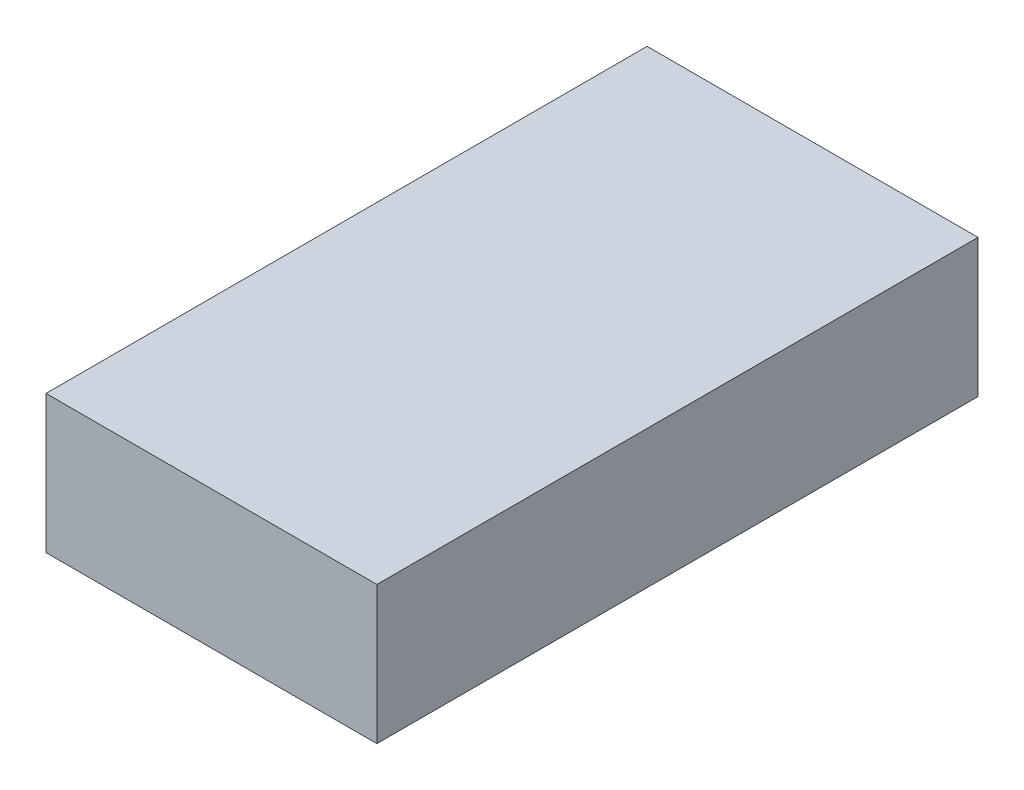
ISO-10303-21;
HEADER;
FILE_DESCRIPTION(('STEP AP214'),'2;1');
FILE_NAME('part.step','',(''),(''),'','','');
FILE_SCHEMA(('AUTOMOTIVE_DESIGN { 1 0 10303 214 1 1 1 1 }'));
ENDSEC;
DATA;
#1=APPLICATION_CONTEXT('core data for automotive mechanical design processes');
#2=APPLICATION_PROTOCOL_DEFINITION('international standard','automotive_design',2000,#1);
#3=PRODUCT_CONTEXT('',#1,'mechanical');
#4=PRODUCT('Part','Part','',(#3));
#5=PRODUCT_RELATED_PRODUCT_CATEGORY('part','',(#4));
#6=PRODUCT_DEFINITION_FORMATION('','',#4);
#7=PRODUCT_DEFINITION_CONTEXT('part definition',#1,'design');
#8=PRODUCT_DEFINITION('design','',#6,#7);
#9=PRODUCT_DEFINITION_SHAPE('','',#8);
#10=(LENGTH_UNIT() NAMED_UNIT(*) SI_UNIT(.MILLI.,.METRE.));
#11=(NAMED_UNIT(*) PLANE_ANGLE_UNIT() SI_UNIT($,.RADIAN.));
#12=(NAMED_UNIT(*) SI_UNIT($,.STERADIAN.) SOLID_ANGLE_UNIT());
#13=UNCERTAINTY_MEASURE_WITH_UNIT(LENGTH_MEASURE(1.E-05),#10,'distance_accuracy_value','');
#14=(GEOMETRIC_REPRESENTATION_CONTEXT(3) GLOBAL_UNCERTAINTY_ASSIGNED_CONTEXT((#13)) GLOBAL_UNIT_ASSIGNED_CONTEXT((#10,
#11,#12)) REPRESENTATION_CONTEXT('',''));
#15=CARTESIAN_POINT('',(0.,0.,0.));
#16=DIRECTION('',(0.,0.,1.));
#17=DIRECTION('',(1.,0.,0.));
#18=AXIS2_PLACEMENT_3D('',#15,#16,#17);
#19=CARTESIAN_POINT('',(-7.1460020219526,5.,21.8));
#20=DIRECTION('',(-1.,0.,0.));
#21=DIRECTION('',(0.,-1.,0.));
#22=AXIS2_PLACEMENT_3D('',#19,#20,#21);
#23=PLANE('',#22);
#24=DIRECTION('',(0.,1.,0.));
#25=VECTOR('',#24,1.);
#26=CARTESIAN_POINT('',(-7.1460020219526,5.,0.));
#27=LINE('',#26,#25);
#28=CARTESIAN_POINT('',(-7.1460020219526,0.,0.));
#29=VERTEX_POINT('',#28);
#30=CARTESIAN_POINT('',(-7.1460020219526,5.,0.));
#31=VERTEX_POINT('',#30);
#32=EDGE_CURVE('E96',#29,#31,#27,.T.);
#33=ORIENTED_EDGE('',*,*,#32,.T.);
#34=DIRECTION('',(0.,0.,-1.));
#35=VECTOR('',#34,1.);
#36=CARTESIAN_POINT('',(-7.1460020219526,5.,21.8));
#37=LINE('',#36,#35);
#38=CARTESIAN_POINT('',(-7.1460020219526,5.,21.8));
#39=VERTEX_POINT('',#38);
#40=EDGE_CURVE('E11',#39,#31,#37,.T.);
#41=ORIENTED_EDGE('',*,*,#40,.F.);
#42=DIRECTION('',(0.,1.,0.));
#43=VECTOR('',#42,1.);
#44=CARTESIAN_POINT('',(-7.1460020219526,5.,21.8));
#45=LINE('',#44,#43);
#46=CARTESIAN_POINT('',(-7.1460020219526,0.,21.8));
#47=VERTEX_POINT('',#46);
#48=EDGE_CURVE('E84',#47,#39,#45,.T.);
#49=ORIENTED_EDGE('',*,*,#48,.F.);
#50=DIRECTION('',(0.,0.,-1.));
#51=VECTOR('',#50,1.);
#52=CARTESIAN_POINT('',(-7.1460020219526,0.,21.8));
#53=LINE('',#52,#51);
#54=EDGE_CURVE('E92',#47,#29,#53,.T.);
#55=ORIENTED_EDGE('',*,*,#54,.T.);
#56=EDGE_LOOP('',(#33,#41,#49,#55));
#57=FACE_BOUND('',#56,.T.);
#58=ADVANCED_FACE('F33',(#57),#23,.F.);
#59=CARTESIAN_POINT('',(-7.1460020219526,5.,21.8));
#60=DIRECTION('',(0.,-1.,0.));
#61=DIRECTION('',(1.,0.,0.));
#62=AXIS2_PLACEMENT_3D('',#59,#60,#61);
#63=PLANE('',#62);
#64=DIRECTION('',(-1.,0.,0.));
#65=VECTOR('',#64,1.);
#66=CARTESIAN_POINT('',(-7.1460020219526,5.,0.));
#67=LINE('',#66,#65);
#68=CARTESIAN_POINT('',(-19.1460020219526,5.,0.));
#69=VERTEX_POINT('',#68);
#70=EDGE_CURVE('E88',#31,#69,#67,.T.);
#71=ORIENTED_EDGE('',*,*,#70,.T.);
#72=DIRECTION('',(0.,0.,-1.));
#73=VECTOR('',#72,1.);
#74=CARTESIAN_POINT('',(-19.1460020219526,5.,21.8));
#75=LINE('',#74,#73);
#76=CARTESIAN_POINT('',(-19.1460020219526,5.,21.8));
#77=VERTEX_POINT('',#76);
#78=EDGE_CURVE('E41',#77,#69,#75,.T.);
#79=ORIENTED_EDGE('',*,*,#78,.F.);
#80=DIRECTION('',(-1.,0.,0.));
#81=VECTOR('',#80,1.);
#82=CARTESIAN_POINT('',(-7.1460020219526,5.,21.8));
#83=LINE('',#82,#81);
#84=EDGE_CURVE('E79',#39,#77,#83,.T.);
#85=ORIENTED_EDGE('',*,*,#84,.F.);
#86=ORIENTED_EDGE('',*,*,#40,.T.);
#87=EDGE_LOOP('',(#71,#79,#85,#86));
#88=FACE_BOUND('',#87,.T.);
#89=ADVANCED_FACE('F87',(#88),#63,.F.);
#90=CARTESIAN_POINT('',(-19.1460020219526,5.,21.8));
#91=DIRECTION('',(1.,0.,0.));
#92=DIRECTION('',(0.,0.,-1.));
#93=AXIS2_PLACEMENT_3D('',#90,#91,#92);
#94=PLANE('',#93);
#95=DIRECTION('',(0.,-1.,0.));
#96=VECTOR('',#95,1.);
#97=CARTESIAN_POINT('',(-19.1460020219526,5.,0.));
#98=LINE('',#97,#96);
#99=CARTESIAN_POINT('',(-19.1460020219526,0.,0.));
#100=VERTEX_POINT('',#99);
#101=EDGE_CURVE('E66',#69,#100,#98,.T.);
#102=ORIENTED_EDGE('',*,*,#101,.T.);
#103=DIRECTION('',(0.,0.,-1.));
#104=VECTOR('',#103,1.);
#105=CARTESIAN_POINT('',(-19.1460020219526,0.,21.8));
#106=LINE('',#105,#104);
#107=CARTESIAN_POINT('',(-19.1460020219526,0.,21.8));
#108=VERTEX_POINT('',#107);
#109=EDGE_CURVE('E89',#108,#100,#106,.T.);
#110=ORIENTED_EDGE('',*,*,#109,.F.);
#111=DIRECTION('',(0.,-1.,0.));
#112=VECTOR('',#111,1.);
#113=CARTESIAN_POINT('',(-19.1460020219526,5.,21.8));
#114=LINE('',#113,#112);
#115=EDGE_CURVE('E82',#77,#108,#114,.T.);
#116=ORIENTED_EDGE('',*,*,#115,.F.);
#117=ORIENTED_EDGE('',*,*,#78,.T.);
#118=EDGE_LOOP('',(#102,#110,#116,#117));
#119=FACE_BOUND('',#118,.T.);
#120=ADVANCED_FACE('F90',(#119),#94,.F.);
#121=CARTESIAN_POINT('',(-7.1460020219526,0.,21.8));
#122=DIRECTION('',(0.,1.,0.));
#123=DIRECTION('',(-1.,0.,0.));
#124=AXIS2_PLACEMENT_3D('',#121,#122,#123);
#125=PLANE('',#124);
#126=DIRECTION('',(1.,0.,0.));
#127=VECTOR('',#126,1.);
#128=CARTESIAN_POINT('',(-7.1460020219526,0.,0.));
#129=LINE('',#128,#127);
#130=EDGE_CURVE('E72',#100,#29,#129,.T.);
#131=ORIENTED_EDGE('',*,*,#130,.T.);
#132=ORIENTED_EDGE('',*,*,#54,.F.);
#133=DIRECTION('',(1.,0.,0.));
#134=VECTOR('',#133,1.);
#135=CARTESIAN_POINT('',(-7.1460020219526,0.,21.8));
#136=LINE('',#135,#134);
#137=EDGE_CURVE('E49',#108,#47,#136,.T.);
#138=ORIENTED_EDGE('',*,*,#137,.F.);
#139=ORIENTED_EDGE('',*,*,#109,.T.);
#140=EDGE_LOOP('',(#131,#132,#138,#139));
#141=FACE_BOUND('',#140,.T.);
#142=ADVANCED_FACE('F103',(#141),#125,.F.);
#143=CARTESIAN_POINT('',(0.,0.,21.8));
#144=DIRECTION('',(0.,0.,-1.));
#145=DIRECTION('',(-1.,0.,0.));
#146=AXIS2_PLACEMENT_3D('',#143,#144,#145);
#147=PLANE('',#146);
#148=ORIENTED_EDGE('',*,*,#48,.T.);
#149=ORIENTED_EDGE('',*,*,#84,.T.);
#150=ORIENTED_EDGE('',*,*,#115,.T.);
#151=ORIENTED_EDGE('',*,*,#137,.T.);
#152=EDGE_LOOP('',(#148,#149,#150,#151));
#153=FACE_BOUND('',#152,.T.);
#154=ADVANCED_FACE('F80',(#153),#147,.F.);
#155=CARTESIAN_POINT('',(0.,0.,0.));
#156=DIRECTION('',(0.,0.,-1.));
#157=DIRECTION('',(-1.,0.,0.));
#158=AXIS2_PLACEMENT_3D('',#155,#156,#157);
#159=PLANE('',#158);
#160=ORIENTED_EDGE('',*,*,#32,.F.);
#161=ORIENTED_EDGE('',*,*,#130,.F.);
#162=ORIENTED_EDGE('',*,*,#101,.F.);
#163=ORIENTED_EDGE('',*,*,#70,.F.);
#164=EDGE_LOOP('',(#160,#161,#162,#163));
#165=FACE_BOUND('',#164,.T.);
#166=ADVANCED_FACE('F106',(#165),#159,.T.);
#167=CLOSED_SHELL('',(#58,#89,#120,#142,#154,#166));
#168=MANIFOLD_SOLID_BREP('B2',#167);
#169=ADVANCED_BREP_SHAPE_REPRESENTATION('',(#18,#168),#14);
#170=SHAPE_DEFINITION_REPRESENTATION(#9,#169);
ENDSEC;
END-ISO-10303-21;
